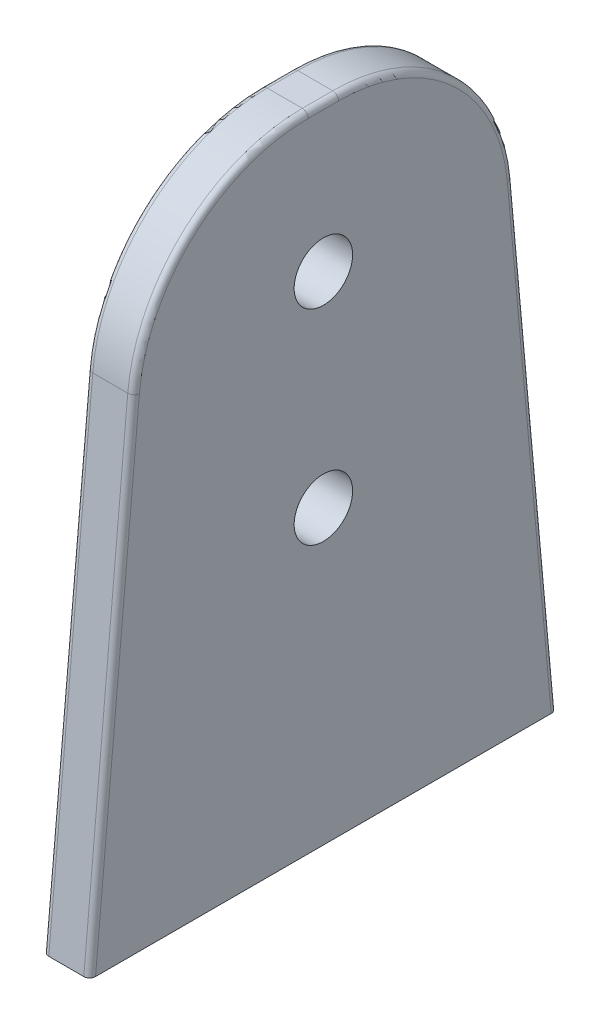
ISO-10303-21;
HEADER;
FILE_DESCRIPTION(('STEP AP214'),'2;1');
FILE_NAME('part.step','',(''),(''),'','','');
FILE_SCHEMA(('AUTOMOTIVE_DESIGN { 1 0 10303 214 1 1 1 1 }'));
ENDSEC;
DATA;
#1=APPLICATION_CONTEXT('core data for automotive mechanical design processes');
#2=APPLICATION_PROTOCOL_DEFINITION('international standard','automotive_design',2000,#1);
#3=PRODUCT_CONTEXT('',#1,'mechanical');
#4=PRODUCT('Part','Part','',(#3));
#5=PRODUCT_RELATED_PRODUCT_CATEGORY('part','',(#4));
#6=PRODUCT_DEFINITION_FORMATION('','',#4);
#7=PRODUCT_DEFINITION_CONTEXT('part definition',#1,'design');
#8=PRODUCT_DEFINITION('design','',#6,#7);
#9=PRODUCT_DEFINITION_SHAPE('','',#8);
#10=(LENGTH_UNIT() NAMED_UNIT(*) SI_UNIT(.MILLI.,.METRE.));
#11=(NAMED_UNIT(*) PLANE_ANGLE_UNIT() SI_UNIT($,.RADIAN.));
#12=(NAMED_UNIT(*) SI_UNIT($,.STERADIAN.) SOLID_ANGLE_UNIT());
#13=UNCERTAINTY_MEASURE_WITH_UNIT(LENGTH_MEASURE(1.E-05),#10,'distance_accuracy_value','');
#14=(GEOMETRIC_REPRESENTATION_CONTEXT(3) GLOBAL_UNCERTAINTY_ASSIGNED_CONTEXT((#13)) GLOBAL_UNIT_ASSIGNED_CONTEXT((#10,
#11,#12)) REPRESENTATION_CONTEXT('',''));
#15=CARTESIAN_POINT('',(0.,0.,0.));
#16=DIRECTION('',(0.,0.,1.));
#17=DIRECTION('',(1.,0.,0.));
#18=AXIS2_PLACEMENT_3D('',#15,#16,#17);
#19=CARTESIAN_POINT('',(8.,0.,0.));
#20=DIRECTION('',(-1.,0.,0.));
#21=DIRECTION('',(0.,0.,1.));
#22=AXIS2_PLACEMENT_3D('',#19,#20,#21);
#23=PLANE('',#22);
#24=DIRECTION('',(0.,0.,-1.));
#25=VECTOR('',#24,1.);
#26=CARTESIAN_POINT('',(8.,0.,-40.));
#27=LINE('',#26,#25);
#28=CARTESIAN_POINT('',(8.,0.,38.9958762711648));
#29=VERTEX_POINT('',#28);
#30=CARTESIAN_POINT('',(8.,0.,-38.9958762711648));
#31=VERTEX_POINT('',#30);
#32=EDGE_CURVE('E235',#29,#31,#27,.T.);
#33=ORIENTED_EDGE('',*,*,#32,.T.);
#34=DIRECTION('',(0.,0.995893206467704,0.0905357460425187));
#35=VECTOR('',#34,1.);
#36=CARTESIAN_POINT('',(8.,3.51602163100667,-38.6762379410733));
#37=LINE('',#36,#35);
#38=CARTESIAN_POINT('',(8.,82.625536635233,-31.48446384978));
#39=VERTEX_POINT('',#38);
#40=EDGE_CURVE('E203',#31,#39,#37,.T.);
#41=ORIENTED_EDGE('',*,*,#40,.T.);
#42=CARTESIAN_POINT('',(8.,80.,-2.60356086221656));
#43=DIRECTION('',(-1.,0.,0.));
#44=DIRECTION('',(0.,0.,1.));
#45=AXIS2_PLACEMENT_3D('',#42,#43,#44);
#46=CIRCLE('',#45,29.);
#47=CARTESIAN_POINT('',(8.,109.,-2.60356086221655));
#48=VERTEX_POINT('',#47);
#49=EDGE_CURVE('E59',#39,#48,#46,.F.);
#50=ORIENTED_EDGE('',*,*,#49,.T.);
#51=DIRECTION('',(0.,0.,1.));
#52=VECTOR('',#51,1.);
#53=CARTESIAN_POINT('',(8.,109.,0.));
#54=LINE('',#53,#52);
#55=CARTESIAN_POINT('',(8.,109.,2.60356086221656));
#56=VERTEX_POINT('',#55);
#57=EDGE_CURVE('E200',#48,#56,#54,.T.);
#58=ORIENTED_EDGE('',*,*,#57,.T.);
#59=CARTESIAN_POINT('',(8.,80.,2.60356086221655));
#60=DIRECTION('',(-1.,0.,0.));
#61=DIRECTION('',(0.,0.,1.));
#62=AXIS2_PLACEMENT_3D('',#59,#60,#61);
#63=CIRCLE('',#62,29.);
#64=CARTESIAN_POINT('',(8.,82.625536635233,31.48446384978));
#65=VERTEX_POINT('',#64);
#66=EDGE_CURVE('E196',#56,#65,#63,.F.);
#67=ORIENTED_EDGE('',*,*,#66,.T.);
#68=DIRECTION('',(0.,-0.995893206467704,0.0905357460425183));
#69=VECTOR('',#68,1.);
#70=CARTESIAN_POINT('',(8.,3.51602163100665,38.6762379410733));
#71=LINE('',#70,#69);
#72=EDGE_CURVE('E198',#65,#29,#71,.T.);
#73=ORIENTED_EDGE('',*,*,#72,.T.);
#74=EDGE_LOOP('',(#33,#41,#50,#58,#67,#73));
#75=FACE_BOUND('',#74,.T.);
#76=CARTESIAN_POINT('',(8.,85.,0.));
#77=DIRECTION('',(1.,0.,0.));
#78=DIRECTION('',(0.,0.,-1.));
#79=AXIS2_PLACEMENT_3D('',#76,#77,#78);
#80=CIRCLE('',#79,5.00000000000001);
#81=CARTESIAN_POINT('',(8.,85.,-5.00000000000001));
#82=VERTEX_POINT('',#81);
#83=EDGE_CURVE('E246',#82,#82,#80,.T.);
#84=ORIENTED_EDGE('',*,*,#83,.F.);
#85=EDGE_LOOP('',(#84));
#86=FACE_BOUND('',#85,.T.);
#87=CARTESIAN_POINT('',(8.,50.,0.));
#88=DIRECTION('',(1.,0.,0.));
#89=DIRECTION('',(0.,0.,-1.));
#90=AXIS2_PLACEMENT_3D('',#87,#88,#89);
#91=CIRCLE('',#90,5.);
#92=CARTESIAN_POINT('',(8.,50.,-5.));
#93=VERTEX_POINT('',#92);
#94=EDGE_CURVE('E452',#93,#93,#91,.T.);
#95=ORIENTED_EDGE('',*,*,#94,.F.);
#96=EDGE_LOOP('',(#95));
#97=FACE_BOUND('',#96,.T.);
#98=ADVANCED_FACE('F35',(#75,#86,#97),#23,.F.);
#99=CARTESIAN_POINT('',(0.,0.,0.));
#100=DIRECTION('',(-1.,0.,0.));
#101=DIRECTION('',(0.,0.,1.));
#102=AXIS2_PLACEMENT_3D('',#99,#100,#101);
#103=PLANE('',#102);
#104=CARTESIAN_POINT('',(0.,85.,0.));
#105=DIRECTION('',(1.,0.,0.));
#106=DIRECTION('',(0.,0.,-1.));
#107=AXIS2_PLACEMENT_3D('',#104,#105,#106);
#108=CIRCLE('',#107,5.00000000000001);
#109=CARTESIAN_POINT('',(0.,85.,-5.00000000000001));
#110=VERTEX_POINT('',#109);
#111=EDGE_CURVE('E249',#110,#110,#108,.T.);
#112=ORIENTED_EDGE('',*,*,#111,.T.);
#113=EDGE_LOOP('',(#112));
#114=FACE_BOUND('',#113,.T.);
#115=CARTESIAN_POINT('',(0.,80.,-2.60356086221656));
#116=DIRECTION('',(-1.,0.,0.));
#117=DIRECTION('',(0.,0.,1.));
#118=AXIS2_PLACEMENT_3D('',#115,#116,#117);
#119=CIRCLE('',#118,29.);
#120=CARTESIAN_POINT('',(0.,109.,-2.60356086221655));
#121=VERTEX_POINT('',#120);
#122=CARTESIAN_POINT('',(0.,82.625536635233,-31.48446384978));
#123=VERTEX_POINT('',#122);
#124=EDGE_CURVE('E177',#121,#123,#119,.T.);
#125=ORIENTED_EDGE('',*,*,#124,.T.);
#126=DIRECTION('',(0.,0.995893206467704,0.0905357460425187));
#127=VECTOR('',#126,1.);
#128=CARTESIAN_POINT('',(0.,-0.0905357460425499,-39.0041067935323));
#129=LINE('',#128,#127);
#130=CARTESIAN_POINT('',(0.,0.,-38.9958762711648));
#131=VERTEX_POINT('',#130);
#132=EDGE_CURVE('E134',#123,#131,#129,.F.);
#133=ORIENTED_EDGE('',*,*,#132,.T.);
#134=DIRECTION('',(0.,0.,-1.));
#135=VECTOR('',#134,1.);
#136=CARTESIAN_POINT('',(0.,0.,-40.));
#137=LINE('',#136,#135);
#138=CARTESIAN_POINT('',(0.,0.,38.9958762711648));
#139=VERTEX_POINT('',#138);
#140=EDGE_CURVE('E242',#139,#131,#137,.T.);
#141=ORIENTED_EDGE('',*,*,#140,.F.);
#142=DIRECTION('',(0.,-0.995893206467704,0.0905357460425183));
#143=VECTOR('',#142,1.);
#144=CARTESIAN_POINT('',(0.,82.625536635233,31.48446384978));
#145=LINE('',#144,#143);
#146=CARTESIAN_POINT('',(0.,82.625536635233,31.48446384978));
#147=VERTEX_POINT('',#146);
#148=EDGE_CURVE('E157',#139,#147,#145,.F.);
#149=ORIENTED_EDGE('',*,*,#148,.T.);
#150=CARTESIAN_POINT('',(0.,80.,2.60356086221655));
#151=DIRECTION('',(-1.,0.,0.));
#152=DIRECTION('',(0.,0.,1.));
#153=AXIS2_PLACEMENT_3D('',#150,#151,#152);
#154=CIRCLE('',#153,29.);
#155=CARTESIAN_POINT('',(0.,109.,2.60356086221656));
#156=VERTEX_POINT('',#155);
#157=EDGE_CURVE('E173',#147,#156,#154,.T.);
#158=ORIENTED_EDGE('',*,*,#157,.T.);
#159=DIRECTION('',(0.,0.,1.));
#160=VECTOR('',#159,1.);
#161=CARTESIAN_POINT('',(0.,109.,-2.60356086221655));
#162=LINE('',#161,#160);
#163=EDGE_CURVE('E175',#156,#121,#162,.F.);
#164=ORIENTED_EDGE('',*,*,#163,.T.);
#165=EDGE_LOOP('',(#125,#133,#141,#149,#158,#164));
#166=FACE_BOUND('',#165,.T.);
#167=CARTESIAN_POINT('',(0.,50.,0.));
#168=DIRECTION('',(1.,0.,0.));
#169=DIRECTION('',(0.,0.,-1.));
#170=AXIS2_PLACEMENT_3D('',#167,#168,#169);
#171=CIRCLE('',#170,5.);
#172=CARTESIAN_POINT('',(0.,50.,-5.));
#173=VERTEX_POINT('',#172);
#174=EDGE_CURVE('E213',#173,#173,#171,.T.);
#175=ORIENTED_EDGE('',*,*,#174,.T.);
#176=EDGE_LOOP('',(#175));
#177=FACE_BOUND('',#176,.T.);
#178=ADVANCED_FACE('F268',(#114,#166,#177),#103,.T.);
#179=CARTESIAN_POINT('',(8.,110.,-30.));
#180=DIRECTION('',(0.,-0.0905357460425187,0.995893206467704));
#181=DIRECTION('',(0.,-0.995893206467704,-0.0905357460425187));
#182=AXIS2_PLACEMENT_3D('',#179,#180,#181);
#183=PLANE('',#182);
#184=DIRECTION('',(-1.,0.,0.));
#185=VECTOR('',#184,1.);
#186=CARTESIAN_POINT('',(8.,0.,-40.));
#187=LINE('',#186,#185);
#188=CARTESIAN_POINT('',(7.,0.,-40.));
#189=VERTEX_POINT('',#188);
#190=CARTESIAN_POINT('',(1.,0.,-40.));
#191=VERTEX_POINT('',#190);
#192=EDGE_CURVE('E156',#189,#191,#187,.T.);
#193=ORIENTED_EDGE('',*,*,#192,.T.);
#194=DIRECTION('',(0.,0.995893206467704,0.0905357460425187));
#195=VECTOR('',#194,1.);
#196=CARTESIAN_POINT('',(1.,82.7160723812756,-32.4803570562477));
#197=LINE('',#196,#195);
#198=CARTESIAN_POINT('',(1.,82.7160723812756,-32.4803570562477));
#199=VERTEX_POINT('',#198);
#200=EDGE_CURVE('E133',#191,#199,#197,.T.);
#201=ORIENTED_EDGE('',*,*,#200,.T.);
#202=DIRECTION('',(-1.,0.,0.));
#203=VECTOR('',#202,1.);
#204=CARTESIAN_POINT('',(8.,82.7160723812756,-32.4803570562477));
#205=LINE('',#204,#203);
#206=CARTESIAN_POINT('',(7.,82.7160723812756,-32.4803570562477));
#207=VERTEX_POINT('',#206);
#208=EDGE_CURVE('E154',#199,#207,#205,.F.);
#209=ORIENTED_EDGE('',*,*,#208,.T.);
#210=DIRECTION('',(0.,0.995893206467704,0.0905357460425187));
#211=VECTOR('',#210,1.);
#212=CARTESIAN_POINT('',(7.,110.,-30.));
#213=LINE('',#212,#211);
#214=EDGE_CURVE('E158',#207,#189,#213,.F.);
#215=ORIENTED_EDGE('',*,*,#214,.T.);
#216=EDGE_LOOP('',(#193,#201,#209,#215));
#217=FACE_BOUND('',#216,.T.);
#218=ADVANCED_FACE('F153',(#217),#183,.F.);
#219=CARTESIAN_POINT('',(8.,110.,30.));
#220=DIRECTION('',(0.,-1.,0.));
#221=DIRECTION('',(0.,0.,-1.));
#222=AXIS2_PLACEMENT_3D('',#219,#220,#221);
#223=PLANE('',#222);
#224=DIRECTION('',(-1.,0.,0.));
#225=VECTOR('',#224,1.);
#226=CARTESIAN_POINT('',(8.,110.,-2.60356086221655));
#227=LINE('',#226,#225);
#228=CARTESIAN_POINT('',(7.,110.,-2.60356086221655));
#229=VERTEX_POINT('',#228);
#230=CARTESIAN_POINT('',(1.,110.,-2.60356086221655));
#231=VERTEX_POINT('',#230);
#232=EDGE_CURVE('E163',#229,#231,#227,.T.);
#233=ORIENTED_EDGE('',*,*,#232,.T.);
#234=DIRECTION('',(0.,0.,1.));
#235=VECTOR('',#234,1.);
#236=CARTESIAN_POINT('',(1.,110.,2.60356086221656));
#237=LINE('',#236,#235);
#238=CARTESIAN_POINT('',(1.,110.,2.60356086221656));
#239=VERTEX_POINT('',#238);
#240=EDGE_CURVE('E190',#231,#239,#237,.T.);
#241=ORIENTED_EDGE('',*,*,#240,.T.);
#242=DIRECTION('',(-1.,0.,0.));
#243=VECTOR('',#242,1.);
#244=CARTESIAN_POINT('',(8.,110.,2.60356086221656));
#245=LINE('',#244,#243);
#246=CARTESIAN_POINT('',(7.,110.,2.60356086221656));
#247=VERTEX_POINT('',#246);
#248=EDGE_CURVE('E167',#239,#247,#245,.F.);
#249=ORIENTED_EDGE('',*,*,#248,.T.);
#250=DIRECTION('',(0.,0.,1.));
#251=VECTOR('',#250,1.);
#252=CARTESIAN_POINT('',(7.,110.,30.));
#253=LINE('',#252,#251);
#254=EDGE_CURVE('E147',#247,#229,#253,.F.);
#255=ORIENTED_EDGE('',*,*,#254,.T.);
#256=EDGE_LOOP('',(#233,#241,#249,#255));
#257=FACE_BOUND('',#256,.T.);
#258=ADVANCED_FACE('F255',(#257),#223,.F.);
#259=CARTESIAN_POINT('',(8.,110.,30.));
#260=DIRECTION('',(0.,-0.0905357460425183,-0.995893206467704));
#261=DIRECTION('',(0.,0.995893206467704,-0.0905357460425183));
#262=AXIS2_PLACEMENT_3D('',#259,#260,#261);
#263=PLANE('',#262);
#264=DIRECTION('',(-1.,0.,0.));
#265=VECTOR('',#264,1.);
#266=CARTESIAN_POINT('',(8.,0.,40.));
#267=LINE('',#266,#265);
#268=CARTESIAN_POINT('',(7.,0.,40.));
#269=VERTEX_POINT('',#268);
#270=CARTESIAN_POINT('',(1.,0.,40.));
#271=VERTEX_POINT('',#270);
#272=EDGE_CURVE('E244',#269,#271,#267,.T.);
#273=ORIENTED_EDGE('',*,*,#272,.F.);
#274=DIRECTION('',(0.,-0.995893206467704,0.0905357460425183));
#275=VECTOR('',#274,1.);
#276=CARTESIAN_POINT('',(7.,110.,30.));
#277=LINE('',#276,#275);
#278=CARTESIAN_POINT('',(7.,82.7160723812755,32.4803570562477));
#279=VERTEX_POINT('',#278);
#280=EDGE_CURVE('E11',#269,#279,#277,.F.);
#281=ORIENTED_EDGE('',*,*,#280,.T.);
#282=DIRECTION('',(-1.,0.,0.));
#283=VECTOR('',#282,1.);
#284=CARTESIAN_POINT('',(8.,82.7160723812755,32.4803570562477));
#285=LINE('',#284,#283);
#286=CARTESIAN_POINT('',(1.,82.7160723812755,32.4803570562477));
#287=VERTEX_POINT('',#286);
#288=EDGE_CURVE('E162',#279,#287,#285,.T.);
#289=ORIENTED_EDGE('',*,*,#288,.T.);
#290=DIRECTION('',(0.,-0.995893206467704,0.0905357460425183));
#291=VECTOR('',#290,1.);
#292=CARTESIAN_POINT('',(1.,0.,40.));
#293=LINE('',#292,#291);
#294=EDGE_CURVE('E44',#287,#271,#293,.T.);
#295=ORIENTED_EDGE('',*,*,#294,.T.);
#296=EDGE_LOOP('',(#273,#281,#289,#295));
#297=FACE_BOUND('',#296,.T.);
#298=ADVANCED_FACE('F302',(#297),#263,.F.);
#299=CARTESIAN_POINT('',(8.,0.,-40.));
#300=DIRECTION('',(0.,1.,0.));
#301=DIRECTION('',(0.,0.,1.));
#302=AXIS2_PLACEMENT_3D('',#299,#300,#301);
#303=PLANE('',#302);
#304=ORIENTED_EDGE('',*,*,#140,.T.);
#305=CARTESIAN_POINT('',(1.,0.,-38.9958762711648));
#306=DIRECTION('',(0.,1.,0.));
#307=DIRECTION('',(0.,0.,-1.));
#308=AXIS2_PLACEMENT_3D('',#305,#306,#307);
#309=ELLIPSE('',#308,1.00412372883521,1.);
#310=EDGE_CURVE('E186',#131,#191,#309,.F.);
#311=ORIENTED_EDGE('',*,*,#310,.T.);
#312=ORIENTED_EDGE('',*,*,#192,.F.);
#313=CARTESIAN_POINT('',(7.,0.,-38.9958762711648));
#314=DIRECTION('',(0.,1.,0.));
#315=DIRECTION('',(0.,0.,1.));
#316=AXIS2_PLACEMENT_3D('',#313,#314,#315);
#317=ELLIPSE('',#316,1.00412372883521,1.);
#318=EDGE_CURVE('E184',#189,#31,#317,.F.);
#319=ORIENTED_EDGE('',*,*,#318,.T.);
#320=ORIENTED_EDGE('',*,*,#32,.F.);
#321=CARTESIAN_POINT('',(7.,0.,38.9958762711648));
#322=DIRECTION('',(0.,1.,0.));
#323=DIRECTION('',(0.,0.,1.));
#324=AXIS2_PLACEMENT_3D('',#321,#322,#323);
#325=ELLIPSE('',#324,1.00412372883521,1.);
#326=EDGE_CURVE('E182',#29,#269,#325,.F.);
#327=ORIENTED_EDGE('',*,*,#326,.T.);
#328=ORIENTED_EDGE('',*,*,#272,.T.);
#329=CARTESIAN_POINT('',(1.,0.,38.9958762711648));
#330=DIRECTION('',(0.,1.,0.));
#331=DIRECTION('',(0.,0.,-1.));
#332=AXIS2_PLACEMENT_3D('',#329,#330,#331);
#333=ELLIPSE('',#332,1.00412372883521,1.);
#334=EDGE_CURVE('E180',#271,#139,#333,.F.);
#335=ORIENTED_EDGE('',*,*,#334,.T.);
#336=EDGE_LOOP('',(#304,#311,#312,#319,#320,#327,#328,#335));
#337=FACE_BOUND('',#336,.T.);
#338=ADVANCED_FACE('F238',(#337),#303,.F.);
#339=CARTESIAN_POINT('',(8.,85.,0.));
#340=DIRECTION('',(-1.,0.,0.));
#341=DIRECTION('',(0.,0.,1.));
#342=AXIS2_PLACEMENT_3D('',#339,#340,#341);
#343=CYLINDRICAL_SURFACE('',#342,5.00000000000001);
#344=ORIENTED_EDGE('',*,*,#83,.T.);
#345=EDGE_LOOP('',(#344));
#346=FACE_BOUND('',#345,.T.);
#347=ORIENTED_EDGE('',*,*,#111,.F.);
#348=EDGE_LOOP('',(#347));
#349=FACE_BOUND('',#348,.T.);
#350=ADVANCED_FACE('F297',(#346,#349),#343,.F.);
#351=CARTESIAN_POINT('',(8.,50.,0.));
#352=DIRECTION('',(-1.,0.,0.));
#353=DIRECTION('',(0.,0.,1.));
#354=AXIS2_PLACEMENT_3D('',#351,#352,#353);
#355=CYLINDRICAL_SURFACE('',#354,5.);
#356=ORIENTED_EDGE('',*,*,#94,.T.);
#357=EDGE_LOOP('',(#356));
#358=FACE_BOUND('',#357,.T.);
#359=ORIENTED_EDGE('',*,*,#174,.F.);
#360=EDGE_LOOP('',(#359));
#361=FACE_BOUND('',#360,.T.);
#362=ADVANCED_FACE('F313',(#358,#361),#355,.F.);
#363=CARTESIAN_POINT('',(8.,80.,-2.60356086221656));
#364=DIRECTION('',(-1.,0.,0.));
#365=DIRECTION('',(0.,0.,1.));
#366=AXIS2_PLACEMENT_3D('',#363,#364,#365);
#367=CYLINDRICAL_SURFACE('',#366,30.);
#368=ORIENTED_EDGE('',*,*,#208,.F.);
#369=CARTESIAN_POINT('',(1.,80.,-2.60356086221656));
#370=DIRECTION('',(-1.,0.,0.));
#371=DIRECTION('',(0.,0.,1.));
#372=AXIS2_PLACEMENT_3D('',#369,#370,#371);
#373=CIRCLE('',#372,30.);
#374=EDGE_CURVE('E140',#199,#231,#373,.F.);
#375=ORIENTED_EDGE('',*,*,#374,.T.);
#376=ORIENTED_EDGE('',*,*,#232,.F.);
#377=CARTESIAN_POINT('',(7.,80.,-2.60356086221656));
#378=DIRECTION('',(-1.,0.,0.));
#379=DIRECTION('',(0.,0.,1.));
#380=AXIS2_PLACEMENT_3D('',#377,#378,#379);
#381=CIRCLE('',#380,30.);
#382=EDGE_CURVE('E148',#229,#207,#381,.T.);
#383=ORIENTED_EDGE('',*,*,#382,.T.);
#384=EDGE_LOOP('',(#368,#375,#376,#383));
#385=FACE_BOUND('',#384,.T.);
#386=ADVANCED_FACE('F160',(#385),#367,.T.);
#387=CARTESIAN_POINT('',(8.,80.,2.60356086221655));
#388=DIRECTION('',(-1.,0.,0.));
#389=DIRECTION('',(0.,0.,1.));
#390=AXIS2_PLACEMENT_3D('',#387,#388,#389);
#391=CYLINDRICAL_SURFACE('',#390,30.);
#392=ORIENTED_EDGE('',*,*,#248,.F.);
#393=CARTESIAN_POINT('',(1.,80.,2.60356086221655));
#394=DIRECTION('',(-1.,0.,0.));
#395=DIRECTION('',(0.,0.,1.));
#396=AXIS2_PLACEMENT_3D('',#393,#394,#395);
#397=CIRCLE('',#396,30.);
#398=EDGE_CURVE('E194',#239,#287,#397,.F.);
#399=ORIENTED_EDGE('',*,*,#398,.T.);
#400=ORIENTED_EDGE('',*,*,#288,.F.);
#401=CARTESIAN_POINT('',(7.,80.,2.60356086221655));
#402=DIRECTION('',(-1.,0.,0.));
#403=DIRECTION('',(0.,0.,1.));
#404=AXIS2_PLACEMENT_3D('',#401,#402,#403);
#405=CIRCLE('',#404,30.);
#406=EDGE_CURVE('E192',#279,#247,#405,.T.);
#407=ORIENTED_EDGE('',*,*,#406,.T.);
#408=EDGE_LOOP('',(#392,#399,#400,#407));
#409=FACE_BOUND('',#408,.T.);
#410=ADVANCED_FACE('F312',(#409),#391,.T.);
#411=CARTESIAN_POINT('',(1.,109.909464253957,29.0041067935323));
#412=DIRECTION('',(0.,0.995893206467704,-0.0905357460425183));
#413=DIRECTION('',(0.,0.0905357460425183,0.995893206467704));
#414=AXIS2_PLACEMENT_3D('',#411,#412,#413);
#415=CYLINDRICAL_SURFACE('',#414,1.);
#416=ORIENTED_EDGE('',*,*,#334,.F.);
#417=ORIENTED_EDGE('',*,*,#294,.F.);
#418=CARTESIAN_POINT('',(1.,82.625536635233,31.48446384978));
#419=DIRECTION('',(0.,0.995893206467704,-0.0905357460425223));
#420=DIRECTION('',(0.,0.0905357460425223,0.995893206467704));
#421=AXIS2_PLACEMENT_3D('',#418,#419,#420);
#422=CIRCLE('',#421,1.);
#423=EDGE_CURVE('E210',#147,#287,#422,.T.);
#424=ORIENTED_EDGE('',*,*,#423,.F.);
#425=ORIENTED_EDGE('',*,*,#148,.F.);
#426=EDGE_LOOP('',(#416,#417,#424,#425));
#427=FACE_BOUND('',#426,.T.);
#428=ADVANCED_FACE('F272',(#427),#415,.T.);
#429=CARTESIAN_POINT('',(1.,80.,2.60356086221655));
#430=DIRECTION('',(-1.,0.,0.));
#431=DIRECTION('',(0.,0.,1.));
#432=AXIS2_PLACEMENT_3D('',#429,#430,#431);
#433=TOROIDAL_SURFACE('',#432,29.,1.);
#434=ORIENTED_EDGE('',*,*,#423,.T.);
#435=ORIENTED_EDGE('',*,*,#398,.F.);
#436=CARTESIAN_POINT('',(1.,109.,2.60356086221656));
#437=DIRECTION('',(0.,0.,-1.));
#438=DIRECTION('',(0.,1.,0.));
#439=AXIS2_PLACEMENT_3D('',#436,#437,#438);
#440=CIRCLE('',#439,1.);
#441=EDGE_CURVE('E207',#156,#239,#440,.T.);
#442=ORIENTED_EDGE('',*,*,#441,.F.);
#443=ORIENTED_EDGE('',*,*,#157,.F.);
#444=EDGE_LOOP('',(#434,#435,#442,#443));
#445=FACE_BOUND('',#444,.T.);
#446=ADVANCED_FACE('F277',(#445),#433,.T.);
#447=CARTESIAN_POINT('',(1.,109.,30.));
#448=DIRECTION('',(0.,0.,-1.));
#449=DIRECTION('',(0.,1.,0.));
#450=AXIS2_PLACEMENT_3D('',#447,#448,#449);
#451=CYLINDRICAL_SURFACE('',#450,1.);
#452=ORIENTED_EDGE('',*,*,#441,.T.);
#453=ORIENTED_EDGE('',*,*,#240,.F.);
#454=CARTESIAN_POINT('',(1.,109.,-2.60356086221655));
#455=DIRECTION('',(0.,0.,-1.));
#456=DIRECTION('',(0.,1.,0.));
#457=AXIS2_PLACEMENT_3D('',#454,#455,#456);
#458=CIRCLE('',#457,1.);
#459=EDGE_CURVE('E137',#121,#231,#458,.T.);
#460=ORIENTED_EDGE('',*,*,#459,.F.);
#461=ORIENTED_EDGE('',*,*,#163,.F.);
#462=EDGE_LOOP('',(#452,#453,#460,#461));
#463=FACE_BOUND('',#462,.T.);
#464=ADVANCED_FACE('F280',(#463),#451,.T.);
#465=CARTESIAN_POINT('',(1.,80.,-2.60356086221656));
#466=DIRECTION('',(-1.,0.,0.));
#467=DIRECTION('',(0.,0.,1.));
#468=AXIS2_PLACEMENT_3D('',#465,#466,#467);
#469=TOROIDAL_SURFACE('',#468,29.,1.);
#470=ORIENTED_EDGE('',*,*,#459,.T.);
#471=ORIENTED_EDGE('',*,*,#374,.F.);
#472=CARTESIAN_POINT('',(1.,82.625536635233,-31.48446384978));
#473=DIRECTION('',(0.,-0.995893206467704,-0.0905357460425223));
#474=DIRECTION('',(0.,0.0905357460425223,-0.995893206467704));
#475=AXIS2_PLACEMENT_3D('',#472,#473,#474);
#476=CIRCLE('',#475,1.);
#477=EDGE_CURVE('E128',#123,#199,#476,.T.);
#478=ORIENTED_EDGE('',*,*,#477,.F.);
#479=ORIENTED_EDGE('',*,*,#124,.F.);
#480=EDGE_LOOP('',(#470,#471,#478,#479));
#481=FACE_BOUND('',#480,.T.);
#482=ADVANCED_FACE('F141',(#481),#469,.T.);
#483=CARTESIAN_POINT('',(1.,109.909464253957,-29.0041067935323));
#484=DIRECTION('',(0.,-0.995893206467704,-0.0905357460425187));
#485=DIRECTION('',(0.,0.0905357460425187,-0.995893206467704));
#486=AXIS2_PLACEMENT_3D('',#483,#484,#485);
#487=CYLINDRICAL_SURFACE('',#486,1.);
#488=ORIENTED_EDGE('',*,*,#310,.F.);
#489=ORIENTED_EDGE('',*,*,#132,.F.);
#490=ORIENTED_EDGE('',*,*,#477,.T.);
#491=ORIENTED_EDGE('',*,*,#200,.F.);
#492=EDGE_LOOP('',(#488,#489,#490,#491));
#493=FACE_BOUND('',#492,.T.);
#494=ADVANCED_FACE('F131',(#493),#487,.T.);
#495=CARTESIAN_POINT('',(7.,3.51602163100665,38.6762379410733));
#496=DIRECTION('',(0.,-0.995893206467704,0.0905357460425183));
#497=DIRECTION('',(0.,-0.0905357460425183,-0.995893206467704));
#498=AXIS2_PLACEMENT_3D('',#495,#496,#497);
#499=CYLINDRICAL_SURFACE('',#498,1.);
#500=ORIENTED_EDGE('',*,*,#326,.F.);
#501=ORIENTED_EDGE('',*,*,#72,.F.);
#502=CARTESIAN_POINT('',(7.,82.625536635233,31.48446384978));
#503=DIRECTION('',(0.,0.995893206467704,-0.0905357460425223));
#504=DIRECTION('',(0.,0.0905357460425223,0.995893206467704));
#505=AXIS2_PLACEMENT_3D('',#502,#503,#504);
#506=CIRCLE('',#505,1.);
#507=EDGE_CURVE('E39',#279,#65,#506,.T.);
#508=ORIENTED_EDGE('',*,*,#507,.F.);
#509=ORIENTED_EDGE('',*,*,#280,.F.);
#510=EDGE_LOOP('',(#500,#501,#508,#509));
#511=FACE_BOUND('',#510,.T.);
#512=ADVANCED_FACE('F37',(#511),#499,.T.);
#513=CARTESIAN_POINT('',(7.,80.,2.60356086221655));
#514=DIRECTION('',(-1.,0.,0.));
#515=DIRECTION('',(0.,0.,1.));
#516=AXIS2_PLACEMENT_3D('',#513,#514,#515);
#517=TOROIDAL_SURFACE('',#516,29.,1.);
#518=ORIENTED_EDGE('',*,*,#507,.T.);
#519=ORIENTED_EDGE('',*,*,#66,.F.);
#520=CARTESIAN_POINT('',(7.,109.,2.60356086221656));
#521=DIRECTION('',(0.,0.,-1.));
#522=DIRECTION('',(0.,1.,0.));
#523=AXIS2_PLACEMENT_3D('',#520,#521,#522);
#524=CIRCLE('',#523,1.);
#525=EDGE_CURVE('E217',#247,#56,#524,.T.);
#526=ORIENTED_EDGE('',*,*,#525,.F.);
#527=ORIENTED_EDGE('',*,*,#406,.F.);
#528=EDGE_LOOP('',(#518,#519,#526,#527));
#529=FACE_BOUND('',#528,.T.);
#530=ADVANCED_FACE('F227',(#529),#517,.T.);
#531=CARTESIAN_POINT('',(7.,109.,0.));
#532=DIRECTION('',(0.,0.,1.));
#533=DIRECTION('',(0.,-1.,0.));
#534=AXIS2_PLACEMENT_3D('',#531,#532,#533);
#535=CYLINDRICAL_SURFACE('',#534,1.);
#536=ORIENTED_EDGE('',*,*,#525,.T.);
#537=ORIENTED_EDGE('',*,*,#57,.F.);
#538=CARTESIAN_POINT('',(7.,109.,-2.60356086221655));
#539=DIRECTION('',(0.,0.,-1.));
#540=DIRECTION('',(0.,1.,0.));
#541=AXIS2_PLACEMENT_3D('',#538,#539,#540);
#542=CIRCLE('',#541,1.);
#543=EDGE_CURVE('E215',#229,#48,#542,.T.);
#544=ORIENTED_EDGE('',*,*,#543,.F.);
#545=ORIENTED_EDGE('',*,*,#254,.F.);
#546=EDGE_LOOP('',(#536,#537,#544,#545));
#547=FACE_BOUND('',#546,.T.);
#548=ADVANCED_FACE('F260',(#547),#535,.T.);
#549=CARTESIAN_POINT('',(7.,80.,-2.60356086221656));
#550=DIRECTION('',(-1.,0.,0.));
#551=DIRECTION('',(0.,0.,1.));
#552=AXIS2_PLACEMENT_3D('',#549,#550,#551);
#553=TOROIDAL_SURFACE('',#552,29.,1.);
#554=ORIENTED_EDGE('',*,*,#543,.T.);
#555=ORIENTED_EDGE('',*,*,#49,.F.);
#556=CARTESIAN_POINT('',(7.,82.625536635233,-31.48446384978));
#557=DIRECTION('',(0.,-0.995893206467704,-0.0905357460425223));
#558=DIRECTION('',(0.,0.0905357460425223,-0.995893206467704));
#559=AXIS2_PLACEMENT_3D('',#556,#557,#558);
#560=CIRCLE('',#559,1.);
#561=EDGE_CURVE('E52',#207,#39,#560,.T.);
#562=ORIENTED_EDGE('',*,*,#561,.F.);
#563=ORIENTED_EDGE('',*,*,#382,.F.);
#564=EDGE_LOOP('',(#554,#555,#562,#563));
#565=FACE_BOUND('',#564,.T.);
#566=ADVANCED_FACE('F262',(#565),#553,.T.);
#567=CARTESIAN_POINT('',(7.,3.51602163100667,-38.6762379410733));
#568=DIRECTION('',(0.,0.995893206467704,0.0905357460425187));
#569=DIRECTION('',(0.,-0.0905357460425187,0.995893206467704));
#570=AXIS2_PLACEMENT_3D('',#567,#568,#569);
#571=CYLINDRICAL_SURFACE('',#570,1.);
#572=ORIENTED_EDGE('',*,*,#318,.F.);
#573=ORIENTED_EDGE('',*,*,#214,.F.);
#574=ORIENTED_EDGE('',*,*,#561,.T.);
#575=ORIENTED_EDGE('',*,*,#40,.F.);
#576=EDGE_LOOP('',(#572,#573,#574,#575));
#577=FACE_BOUND('',#576,.T.);
#578=ADVANCED_FACE('F263',(#577),#571,.T.);
#579=CLOSED_SHELL('',(#98,#178,#218,#258,#298,#338,#350,#362,#386,#410,#428,#446,#464,#482,#494,
#512,#530,#548,#566,#578));
#580=MANIFOLD_SOLID_BREP('B2',#579);
#581=ADVANCED_BREP_SHAPE_REPRESENTATION('',(#18,#580),#14);
#582=SHAPE_DEFINITION_REPRESENTATION(#9,#581);
ENDSEC;
END-ISO-10303-21;
